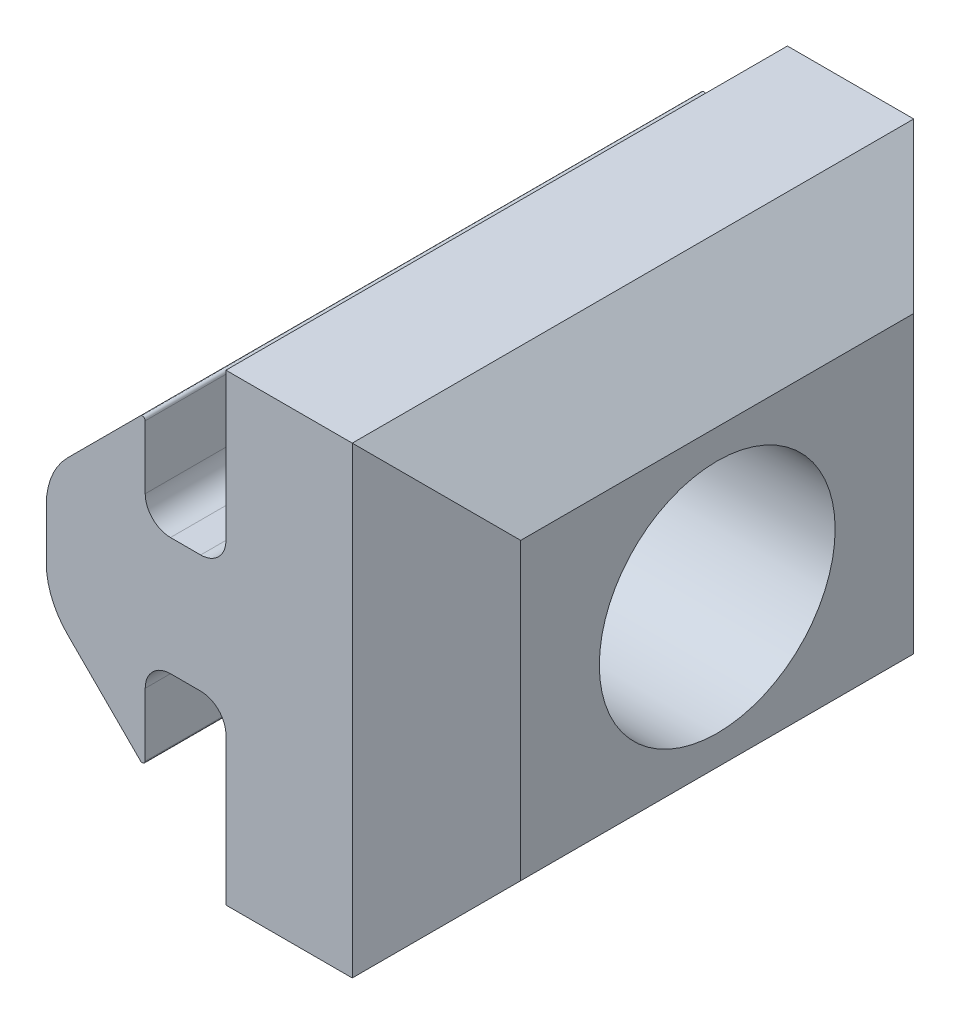
ISO-10303-21;
HEADER;
FILE_DESCRIPTION(('STEP AP214'),'2;1');
FILE_NAME('part.step','',(''),(''),'','','');
FILE_SCHEMA(('AUTOMOTIVE_DESIGN { 1 0 10303 214 1 1 1 1 }'));
ENDSEC;
DATA;
#1=APPLICATION_CONTEXT('core data for automotive mechanical design processes');
#2=APPLICATION_PROTOCOL_DEFINITION('international standard','automotive_design',2000,#1);
#3=PRODUCT_CONTEXT('',#1,'mechanical');
#4=PRODUCT('Part','Part','',(#3));
#5=PRODUCT_RELATED_PRODUCT_CATEGORY('part','',(#4));
#6=PRODUCT_DEFINITION_FORMATION('','',#4);
#7=PRODUCT_DEFINITION_CONTEXT('part definition',#1,'design');
#8=PRODUCT_DEFINITION('design','',#6,#7);
#9=PRODUCT_DEFINITION_SHAPE('','',#8);
#10=(LENGTH_UNIT() NAMED_UNIT(*) SI_UNIT(.MILLI.,.METRE.));
#11=(NAMED_UNIT(*) PLANE_ANGLE_UNIT() SI_UNIT($,.RADIAN.));
#12=(NAMED_UNIT(*) SI_UNIT($,.STERADIAN.) SOLID_ANGLE_UNIT());
#13=UNCERTAINTY_MEASURE_WITH_UNIT(LENGTH_MEASURE(1.E-05),#10,'distance_accuracy_value','');
#14=(GEOMETRIC_REPRESENTATION_CONTEXT(3) GLOBAL_UNCERTAINTY_ASSIGNED_CONTEXT((#13)) GLOBAL_UNIT_ASSIGNED_CONTEXT((#10,
#11,#12)) REPRESENTATION_CONTEXT('',''));
#15=CARTESIAN_POINT('',(0.,0.,0.));
#16=DIRECTION('',(0.,0.,1.));
#17=DIRECTION('',(1.,0.,0.));
#18=AXIS2_PLACEMENT_3D('',#15,#16,#17);
#19=CARTESIAN_POINT('',(-1.38582598381851,-2.26642728526669,20.));
#20=DIRECTION('',(0.,0.,-1.));
#21=DIRECTION('',(-1.,0.,0.));
#22=AXIS2_PLACEMENT_3D('',#19,#20,#21);
#23=CYLINDRICAL_SURFACE('',#22,0.900000000000001);
#24=CARTESIAN_POINT('',(-1.38582598381851,-2.26642728526669,0.));
#25=DIRECTION('',(0.,0.,-1.));
#26=DIRECTION('',(1.,0.,0.));
#27=AXIS2_PLACEMENT_3D('',#24,#25,#26);
#28=CIRCLE('',#27,0.900000000000001);
#29=CARTESIAN_POINT('',(-1.38582598381851,-1.36642728526669,0.));
#30=VERTEX_POINT('',#29);
#31=CARTESIAN_POINT('',(-0.485825983818514,-2.26642728526669,0.));
#32=VERTEX_POINT('',#31);
#33=EDGE_CURVE('E217',#30,#32,#28,.T.);
#34=ORIENTED_EDGE('',*,*,#33,.T.);
#35=DIRECTION('',(0.,0.,-1.));
#36=VECTOR('',#35,1.);
#37=CARTESIAN_POINT('',(-0.485825983818514,-2.26642728526669,20.));
#38=LINE('',#37,#36);
#39=CARTESIAN_POINT('',(-0.485825983818514,-2.26642728526669,20.));
#40=VERTEX_POINT('',#39);
#41=EDGE_CURVE('E197',#40,#32,#38,.T.);
#42=ORIENTED_EDGE('',*,*,#41,.F.);
#43=CARTESIAN_POINT('',(-1.38582598381851,-2.26642728526669,20.));
#44=DIRECTION('',(0.,0.,-1.));
#45=DIRECTION('',(1.,0.,0.));
#46=AXIS2_PLACEMENT_3D('',#43,#44,#45);
#47=CIRCLE('',#46,0.900000000000001);
#48=CARTESIAN_POINT('',(-1.38582598381851,-1.36642728526669,20.));
#49=VERTEX_POINT('',#48);
#50=EDGE_CURVE('E204',#49,#40,#47,.T.);
#51=ORIENTED_EDGE('',*,*,#50,.F.);
#52=DIRECTION('',(0.,0.,-1.));
#53=VECTOR('',#52,1.);
#54=CARTESIAN_POINT('',(-1.38582598381851,-1.36642728526669,20.));
#55=LINE('',#54,#53);
#56=EDGE_CURVE('E323',#49,#30,#55,.T.);
#57=ORIENTED_EDGE('',*,*,#56,.T.);
#58=EDGE_LOOP('',(#34,#42,#51,#57));
#59=FACE_BOUND('',#58,.T.);
#60=ADVANCED_FACE('F41',(#59),#23,.F.);
#61=CARTESIAN_POINT('',(-0.485825983818514,-7.51642728526669,20.));
#62=DIRECTION('',(1.,0.,0.));
#63=DIRECTION('',(0.,1.,0.));
#64=AXIS2_PLACEMENT_3D('',#61,#62,#63);
#65=PLANE('',#64);
#66=DIRECTION('',(0.,-1.,0.));
#67=VECTOR('',#66,1.);
#68=CARTESIAN_POINT('',(-0.485825983818514,-7.51642728526669,0.));
#69=LINE('',#68,#67);
#70=CARTESIAN_POINT('',(-0.485825983818514,-7.51642728526669,0.));
#71=VERTEX_POINT('',#70);
#72=EDGE_CURVE('E265',#32,#71,#69,.T.);
#73=ORIENTED_EDGE('',*,*,#72,.T.);
#74=DIRECTION('',(0.,0.,-1.));
#75=VECTOR('',#74,1.);
#76=CARTESIAN_POINT('',(-0.485825983818514,-7.51642728526669,20.));
#77=LINE('',#76,#75);
#78=CARTESIAN_POINT('',(-0.485825983818514,-7.51642728526669,20.));
#79=VERTEX_POINT('',#78);
#80=EDGE_CURVE('E200',#79,#71,#77,.T.);
#81=ORIENTED_EDGE('',*,*,#80,.F.);
#82=DIRECTION('',(0.,-1.,0.));
#83=VECTOR('',#82,1.);
#84=CARTESIAN_POINT('',(-0.485825983818514,-7.51642728526669,20.));
#85=LINE('',#84,#83);
#86=EDGE_CURVE('E193',#40,#79,#85,.T.);
#87=ORIENTED_EDGE('',*,*,#86,.F.);
#88=ORIENTED_EDGE('',*,*,#41,.T.);
#89=EDGE_LOOP('',(#73,#81,#87,#88));
#90=FACE_BOUND('',#89,.T.);
#91=ADVANCED_FACE('F195',(#90),#65,.F.);
#92=CARTESIAN_POINT('',(7.01417401618149,-7.51642728526669,20.));
#93=DIRECTION('',(0.,1.,0.));
#94=DIRECTION('',(0.,0.,1.));
#95=AXIS2_PLACEMENT_3D('',#92,#93,#94);
#96=PLANE('',#95);
#97=DIRECTION('',(1.,0.,0.));
#98=VECTOR('',#97,1.);
#99=CARTESIAN_POINT('',(7.01417401618149,-7.51642728526669,0.));
#100=LINE('',#99,#98);
#101=CARTESIAN_POINT('',(4.01417401618148,-7.51642728526669,0.));
#102=VERTEX_POINT('',#101);
#103=EDGE_CURVE('E268',#71,#102,#100,.T.);
#104=ORIENTED_EDGE('',*,*,#103,.T.);
#105=DIRECTION('',(0.,0.,1.));
#106=VECTOR('',#105,1.);
#107=CARTESIAN_POINT('',(4.01417401618148,-7.51642728526669,20.));
#108=LINE('',#107,#106);
#109=CARTESIAN_POINT('',(4.01417401618148,-7.51642728526669,20.));
#110=VERTEX_POINT('',#109);
#111=EDGE_CURVE('E238',#102,#110,#108,.T.);
#112=ORIENTED_EDGE('',*,*,#111,.T.);
#113=DIRECTION('',(1.,0.,0.));
#114=VECTOR('',#113,1.);
#115=CARTESIAN_POINT('',(7.01417401618149,-7.51642728526669,20.));
#116=LINE('',#115,#114);
#117=EDGE_CURVE('E203',#79,#110,#116,.T.);
#118=ORIENTED_EDGE('',*,*,#117,.F.);
#119=ORIENTED_EDGE('',*,*,#80,.T.);
#120=EDGE_LOOP('',(#104,#112,#118,#119));
#121=FACE_BOUND('',#120,.T.);
#122=ADVANCED_FACE('F456',(#121),#96,.F.);
#123=CARTESIAN_POINT('',(7.01417401618148,8.98357271473331,20.));
#124=DIRECTION('',(-1.,0.,0.));
#125=DIRECTION('',(0.,-1.,0.));
#126=AXIS2_PLACEMENT_3D('',#123,#124,#125);
#127=PLANE('',#126);
#128=CARTESIAN_POINT('',(7.01417401618149,0.733572714733309,10.));
#129=DIRECTION('',(1.,0.,0.));
#130=DIRECTION('',(0.,1.,0.));
#131=AXIS2_PLACEMENT_3D('',#128,#129,#130);
#132=CIRCLE('',#131,4.2);
#133=CARTESIAN_POINT('',(7.01417401618148,4.93357271473331,10.));
#134=VERTEX_POINT('',#133);
#135=EDGE_CURVE('E738',#134,#134,#132,.T.);
#136=ORIENTED_EDGE('',*,*,#135,.F.);
#137=EDGE_LOOP('',(#136));
#138=FACE_BOUND('',#137,.T.);
#139=DIRECTION('',(0.,-1.,0.));
#140=VECTOR('',#139,1.);
#141=CARTESIAN_POINT('',(7.01417401618149,-7.51642728526669,17.));
#142=LINE('',#141,#140);
#143=CARTESIAN_POINT('',(7.01417401618148,5.98357271473331,17.));
#144=VERTEX_POINT('',#143);
#145=CARTESIAN_POINT('',(7.01417401618149,-4.51642728526669,17.));
#146=VERTEX_POINT('',#145);
#147=EDGE_CURVE('E231',#144,#146,#142,.T.);
#148=ORIENTED_EDGE('',*,*,#147,.T.);
#149=DIRECTION('',(0.,0.,-1.));
#150=VECTOR('',#149,1.);
#151=CARTESIAN_POINT('',(7.01417401618149,-4.51642728526669,20.));
#152=LINE('',#151,#150);
#153=CARTESIAN_POINT('',(7.01417401618149,-4.51642728526669,3.));
#154=VERTEX_POINT('',#153);
#155=EDGE_CURVE('E234',#146,#154,#152,.T.);
#156=ORIENTED_EDGE('',*,*,#155,.T.);
#157=DIRECTION('',(0.,1.,0.));
#158=VECTOR('',#157,1.);
#159=CARTESIAN_POINT('',(7.01417401618148,8.98357271473331,3.));
#160=LINE('',#159,#158);
#161=CARTESIAN_POINT('',(7.01417401618148,5.98357271473331,3.));
#162=VERTEX_POINT('',#161);
#163=EDGE_CURVE('E219',#154,#162,#160,.T.);
#164=ORIENTED_EDGE('',*,*,#163,.T.);
#165=DIRECTION('',(0.,0.,1.));
#166=VECTOR('',#165,1.);
#167=CARTESIAN_POINT('',(7.01417401618148,5.98357271473331,20.));
#168=LINE('',#167,#166);
#169=EDGE_CURVE('E223',#162,#144,#168,.T.);
#170=ORIENTED_EDGE('',*,*,#169,.T.);
#171=EDGE_LOOP('',(#148,#156,#164,#170));
#172=FACE_BOUND('',#171,.T.);
#173=ADVANCED_FACE('F571',(#138,#172),#127,.F.);
#174=CARTESIAN_POINT('',(-0.485825983818514,8.98357271473331,20.));
#175=DIRECTION('',(0.,-1.,0.));
#176=DIRECTION('',(0.,0.,-1.));
#177=AXIS2_PLACEMENT_3D('',#174,#175,#176);
#178=PLANE('',#177);
#179=DIRECTION('',(-1.,0.,0.));
#180=VECTOR('',#179,1.);
#181=CARTESIAN_POINT('',(-0.485825983818514,8.98357271473331,20.));
#182=LINE('',#181,#180);
#183=CARTESIAN_POINT('',(4.01417401618147,8.98357271473331,20.));
#184=VERTEX_POINT('',#183);
#185=CARTESIAN_POINT('',(-0.485825983818514,8.98357271473331,20.));
#186=VERTEX_POINT('',#185);
#187=EDGE_CURVE('E459',#184,#186,#182,.T.);
#188=ORIENTED_EDGE('',*,*,#187,.F.);
#189=DIRECTION('',(0.,0.,-1.));
#190=VECTOR('',#189,1.);
#191=CARTESIAN_POINT('',(4.01417401618147,8.98357271473331,20.));
#192=LINE('',#191,#190);
#193=CARTESIAN_POINT('',(4.01417401618147,8.98357271473331,0.));
#194=VERTEX_POINT('',#193);
#195=EDGE_CURVE('E52',#184,#194,#192,.T.);
#196=ORIENTED_EDGE('',*,*,#195,.T.);
#197=DIRECTION('',(-1.,0.,0.));
#198=VECTOR('',#197,1.);
#199=CARTESIAN_POINT('',(-0.485825983818514,8.98357271473331,0.));
#200=LINE('',#199,#198);
#201=CARTESIAN_POINT('',(-0.485825983818514,8.98357271473331,0.));
#202=VERTEX_POINT('',#201);
#203=EDGE_CURVE('E276',#194,#202,#200,.T.);
#204=ORIENTED_EDGE('',*,*,#203,.T.);
#205=DIRECTION('',(0.,0.,-1.));
#206=VECTOR('',#205,1.);
#207=CARTESIAN_POINT('',(-0.485825983818514,8.98357271473331,20.));
#208=LINE('',#207,#206);
#209=EDGE_CURVE('E225',#186,#202,#208,.T.);
#210=ORIENTED_EDGE('',*,*,#209,.F.);
#211=EDGE_LOOP('',(#188,#196,#204,#210));
#212=FACE_BOUND('',#211,.T.);
#213=ADVANCED_FACE('F464',(#212),#178,.F.);
#214=CARTESIAN_POINT('',(-0.485825983818514,3.73357271473331,20.));
#215=DIRECTION('',(1.,0.,0.));
#216=DIRECTION('',(0.,1.,0.));
#217=AXIS2_PLACEMENT_3D('',#214,#215,#216);
#218=PLANE('',#217);
#219=DIRECTION('',(0.,-1.,0.));
#220=VECTOR('',#219,1.);
#221=CARTESIAN_POINT('',(-0.485825983818514,3.73357271473331,0.));
#222=LINE('',#221,#220);
#223=CARTESIAN_POINT('',(-0.485825983818514,3.73357271473331,0.));
#224=VERTEX_POINT('',#223);
#225=EDGE_CURVE('E279',#202,#224,#222,.T.);
#226=ORIENTED_EDGE('',*,*,#225,.T.);
#227=DIRECTION('',(0.,0.,-1.));
#228=VECTOR('',#227,1.);
#229=CARTESIAN_POINT('',(-0.485825983818514,3.73357271473331,20.));
#230=LINE('',#229,#228);
#231=CARTESIAN_POINT('',(-0.485825983818514,3.73357271473331,20.));
#232=VERTEX_POINT('',#231);
#233=EDGE_CURVE('E378',#232,#224,#230,.T.);
#234=ORIENTED_EDGE('',*,*,#233,.F.);
#235=DIRECTION('',(0.,-1.,0.));
#236=VECTOR('',#235,1.);
#237=CARTESIAN_POINT('',(-0.485825983818514,3.73357271473331,20.));
#238=LINE('',#237,#236);
#239=EDGE_CURVE('E389',#186,#232,#238,.T.);
#240=ORIENTED_EDGE('',*,*,#239,.F.);
#241=ORIENTED_EDGE('',*,*,#209,.T.);
#242=EDGE_LOOP('',(#226,#234,#240,#241));
#243=FACE_BOUND('',#242,.T.);
#244=ADVANCED_FACE('F387',(#243),#218,.F.);
#245=CARTESIAN_POINT('',(-1.38582598381851,3.73357271473331,20.));
#246=DIRECTION('',(0.,0.,-1.));
#247=DIRECTION('',(-1.,0.,0.));
#248=AXIS2_PLACEMENT_3D('',#245,#246,#247);
#249=CYLINDRICAL_SURFACE('',#248,0.900000000000001);
#250=CARTESIAN_POINT('',(-1.38582598381851,3.73357271473331,0.));
#251=DIRECTION('',(0.,0.,-1.));
#252=DIRECTION('',(1.,0.,0.));
#253=AXIS2_PLACEMENT_3D('',#250,#251,#252);
#254=CIRCLE('',#253,0.900000000000001);
#255=CARTESIAN_POINT('',(-1.38582598381851,2.83357271473331,0.));
#256=VERTEX_POINT('',#255);
#257=EDGE_CURVE('E282',#224,#256,#254,.T.);
#258=ORIENTED_EDGE('',*,*,#257,.T.);
#259=DIRECTION('',(0.,0.,-1.));
#260=VECTOR('',#259,1.);
#261=CARTESIAN_POINT('',(-1.38582598381851,2.83357271473331,20.));
#262=LINE('',#261,#260);
#263=CARTESIAN_POINT('',(-1.38582598381851,2.83357271473331,20.));
#264=VERTEX_POINT('',#263);
#265=EDGE_CURVE('E374',#264,#256,#262,.T.);
#266=ORIENTED_EDGE('',*,*,#265,.F.);
#267=CARTESIAN_POINT('',(-1.38582598381851,3.73357271473331,20.));
#268=DIRECTION('',(0.,0.,-1.));
#269=DIRECTION('',(1.,0.,0.));
#270=AXIS2_PLACEMENT_3D('',#267,#268,#269);
#271=CIRCLE('',#270,0.900000000000001);
#272=EDGE_CURVE('E407',#232,#264,#271,.T.);
#273=ORIENTED_EDGE('',*,*,#272,.F.);
#274=ORIENTED_EDGE('',*,*,#233,.T.);
#275=EDGE_LOOP('',(#258,#266,#273,#274));
#276=FACE_BOUND('',#275,.T.);
#277=ADVANCED_FACE('F397',(#276),#249,.F.);
#278=CARTESIAN_POINT('',(-2.46120478135976,2.83357271473331,20.));
#279=DIRECTION('',(0.,-1.,0.));
#280=DIRECTION('',(1.,0.,0.));
#281=AXIS2_PLACEMENT_3D('',#278,#279,#280);
#282=PLANE('',#281);
#283=DIRECTION('',(-1.,0.,0.));
#284=VECTOR('',#283,1.);
#285=CARTESIAN_POINT('',(-2.46120478135976,2.83357271473331,0.));
#286=LINE('',#285,#284);
#287=CARTESIAN_POINT('',(-2.46120478135976,2.83357271473331,0.));
#288=VERTEX_POINT('',#287);
#289=EDGE_CURVE('E285',#256,#288,#286,.T.);
#290=ORIENTED_EDGE('',*,*,#289,.T.);
#291=DIRECTION('',(0.,0.,-1.));
#292=VECTOR('',#291,1.);
#293=CARTESIAN_POINT('',(-2.46120478135976,2.83357271473331,20.));
#294=LINE('',#293,#292);
#295=CARTESIAN_POINT('',(-2.46120478135976,2.83357271473331,20.));
#296=VERTEX_POINT('',#295);
#297=EDGE_CURVE('E370',#296,#288,#294,.T.);
#298=ORIENTED_EDGE('',*,*,#297,.F.);
#299=DIRECTION('',(-1.,0.,0.));
#300=VECTOR('',#299,1.);
#301=CARTESIAN_POINT('',(-2.46120478135976,2.83357271473331,20.));
#302=LINE('',#301,#300);
#303=EDGE_CURVE('E403',#264,#296,#302,.T.);
#304=ORIENTED_EDGE('',*,*,#303,.F.);
#305=ORIENTED_EDGE('',*,*,#265,.T.);
#306=EDGE_LOOP('',(#290,#298,#304,#305));
#307=FACE_BOUND('',#306,.T.);
#308=ADVANCED_FACE('F401',(#307),#282,.F.);
#309=CARTESIAN_POINT('',(-2.46120478135976,3.73357271473331,20.));
#310=DIRECTION('',(0.,0.,-1.));
#311=DIRECTION('',(-1.,0.,0.));
#312=AXIS2_PLACEMENT_3D('',#309,#310,#311);
#313=CYLINDRICAL_SURFACE('',#312,0.900000000000001);
#314=CARTESIAN_POINT('',(-2.46120478135976,3.73357271473331,0.));
#315=DIRECTION('',(0.,0.,-1.));
#316=DIRECTION('',(1.,0.,0.));
#317=AXIS2_PLACEMENT_3D('',#314,#315,#316);
#318=CIRCLE('',#317,0.900000000000001);
#319=CARTESIAN_POINT('',(-3.36120478135977,3.73357271473331,0.));
#320=VERTEX_POINT('',#319);
#321=EDGE_CURVE('E288',#288,#320,#318,.T.);
#322=ORIENTED_EDGE('',*,*,#321,.T.);
#323=DIRECTION('',(0.,0.,-1.));
#324=VECTOR('',#323,1.);
#325=CARTESIAN_POINT('',(-3.36120478135977,3.73357271473331,20.));
#326=LINE('',#325,#324);
#327=CARTESIAN_POINT('',(-3.36120478135977,3.73357271473331,20.));
#328=VERTEX_POINT('',#327);
#329=EDGE_CURVE('E366',#328,#320,#326,.T.);
#330=ORIENTED_EDGE('',*,*,#329,.F.);
#331=CARTESIAN_POINT('',(-2.46120478135976,3.73357271473331,20.));
#332=DIRECTION('',(0.,0.,-1.));
#333=DIRECTION('',(1.,0.,0.));
#334=AXIS2_PLACEMENT_3D('',#331,#332,#333);
#335=CIRCLE('',#334,0.900000000000001);
#336=EDGE_CURVE('E406',#296,#328,#335,.T.);
#337=ORIENTED_EDGE('',*,*,#336,.F.);
#338=ORIENTED_EDGE('',*,*,#297,.T.);
#339=EDGE_LOOP('',(#322,#330,#337,#338));
#340=FACE_BOUND('',#339,.T.);
#341=ADVANCED_FACE('F558',(#340),#313,.F.);
#342=CARTESIAN_POINT('',(-3.36120478135977,5.98357271473331,20.));
#343=DIRECTION('',(-1.,0.,0.));
#344=DIRECTION('',(0.,-1.,0.));
#345=AXIS2_PLACEMENT_3D('',#342,#343,#344);
#346=PLANE('',#345);
#347=DIRECTION('',(0.,1.,0.));
#348=VECTOR('',#347,1.);
#349=CARTESIAN_POINT('',(-3.36120478135977,5.98357271473331,0.));
#350=LINE('',#349,#348);
#351=CARTESIAN_POINT('',(-3.36120478135977,5.98357271473331,0.));
#352=VERTEX_POINT('',#351);
#353=EDGE_CURVE('E291',#320,#352,#350,.T.);
#354=ORIENTED_EDGE('',*,*,#353,.T.);
#355=DIRECTION('',(0.,0.,-1.));
#356=VECTOR('',#355,1.);
#357=CARTESIAN_POINT('',(-3.36120478135977,5.98357271473331,20.));
#358=LINE('',#357,#356);
#359=CARTESIAN_POINT('',(-3.36120478135977,5.98357271473331,20.));
#360=VERTEX_POINT('',#359);
#361=EDGE_CURVE('E362',#360,#352,#358,.T.);
#362=ORIENTED_EDGE('',*,*,#361,.F.);
#363=DIRECTION('',(0.,1.,0.));
#364=VECTOR('',#363,1.);
#365=CARTESIAN_POINT('',(-3.36120478135977,5.98357271473331,20.));
#366=LINE('',#365,#364);
#367=EDGE_CURVE('E411',#328,#360,#366,.T.);
#368=ORIENTED_EDGE('',*,*,#367,.F.);
#369=ORIENTED_EDGE('',*,*,#329,.T.);
#370=EDGE_LOOP('',(#354,#362,#368,#369));
#371=FACE_BOUND('',#370,.T.);
#372=ADVANCED_FACE('F554',(#371),#346,.F.);
#373=CARTESIAN_POINT('',(-3.46120478135977,5.98357271473331,20.));
#374=DIRECTION('',(0.,0.,-1.));
#375=DIRECTION('',(-1.,0.,0.));
#376=AXIS2_PLACEMENT_3D('',#373,#374,#375);
#377=CYLINDRICAL_SURFACE('',#376,0.0999999999999998);
#378=CARTESIAN_POINT('',(-3.46120478135977,5.98357271473331,0.));
#379=DIRECTION('',(0.,0.,1.));
#380=DIRECTION('',(1.,0.,0.));
#381=AXIS2_PLACEMENT_3D('',#378,#379,#380);
#382=CIRCLE('',#381,0.0999999999999998);
#383=CARTESIAN_POINT('',(-3.53191545947842,6.05428339285196,0.));
#384=VERTEX_POINT('',#383);
#385=EDGE_CURVE('E294',#352,#384,#382,.T.);
#386=ORIENTED_EDGE('',*,*,#385,.T.);
#387=DIRECTION('',(0.,0.,-1.));
#388=VECTOR('',#387,1.);
#389=CARTESIAN_POINT('',(-3.53191545947842,6.05428339285196,20.));
#390=LINE('',#389,#388);
#391=CARTESIAN_POINT('',(-3.53191545947842,6.05428339285196,20.));
#392=VERTEX_POINT('',#391);
#393=EDGE_CURVE('E358',#392,#384,#390,.T.);
#394=ORIENTED_EDGE('',*,*,#393,.F.);
#395=CARTESIAN_POINT('',(-3.46120478135977,5.98357271473331,20.));
#396=DIRECTION('',(0.,0.,1.));
#397=DIRECTION('',(1.,0.,0.));
#398=AXIS2_PLACEMENT_3D('',#395,#396,#397);
#399=CIRCLE('',#398,0.0999999999999998);
#400=EDGE_CURVE('E418',#360,#392,#399,.T.);
#401=ORIENTED_EDGE('',*,*,#400,.F.);
#402=ORIENTED_EDGE('',*,*,#361,.T.);
#403=EDGE_LOOP('',(#386,#394,#401,#402));
#404=FACE_BOUND('',#403,.T.);
#405=ADVANCED_FACE('F550',(#404),#377,.T.);
#406=CARTESIAN_POINT('',(-6.12430361490354,3.46189523742684,20.));
#407=DIRECTION('',(0.707106781186548,-0.707106781186548,0.));
#408=DIRECTION('',(0.707106781186548,0.707106781186548,0.));
#409=AXIS2_PLACEMENT_3D('',#406,#407,#408);
#410=PLANE('',#409);
#411=DIRECTION('',(-0.707106781186547,-0.707106781186547,0.));
#412=VECTOR('',#411,1.);
#413=CARTESIAN_POINT('',(-6.12430361490354,3.46189523742684,0.));
#414=LINE('',#413,#412);
#415=CARTESIAN_POINT('',(-6.12430361490354,3.46189523742684,0.));
#416=VERTEX_POINT('',#415);
#417=EDGE_CURVE('E297',#384,#416,#414,.T.);
#418=ORIENTED_EDGE('',*,*,#417,.T.);
#419=DIRECTION('',(0.,0.,-1.));
#420=VECTOR('',#419,1.);
#421=CARTESIAN_POINT('',(-6.12430361490354,3.46189523742684,20.));
#422=LINE('',#421,#420);
#423=CARTESIAN_POINT('',(-6.12430361490354,3.46189523742684,20.));
#424=VERTEX_POINT('',#423);
#425=EDGE_CURVE('E354',#424,#416,#422,.T.);
#426=ORIENTED_EDGE('',*,*,#425,.F.);
#427=DIRECTION('',(-0.707106781186547,-0.707106781186547,0.));
#428=VECTOR('',#427,1.);
#429=CARTESIAN_POINT('',(-6.12430361490354,3.46189523742684,20.));
#430=LINE('',#429,#428);
#431=EDGE_CURVE('E421',#392,#424,#430,.T.);
#432=ORIENTED_EDGE('',*,*,#431,.F.);
#433=ORIENTED_EDGE('',*,*,#393,.T.);
#434=EDGE_LOOP('',(#418,#426,#432,#433));
#435=FACE_BOUND('',#434,.T.);
#436=ADVANCED_FACE('F546',(#435),#410,.F.);
#437=CARTESIAN_POINT('',(-4.28582598381852,1.62341760634182,20.));
#438=DIRECTION('',(0.,0.,-1.));
#439=DIRECTION('',(-1.,0.,0.));
#440=AXIS2_PLACEMENT_3D('',#437,#438,#439);
#441=CYLINDRICAL_SURFACE('',#440,2.6);
#442=CARTESIAN_POINT('',(-4.28582598381852,1.62341760634182,0.));
#443=DIRECTION('',(0.,0.,1.));
#444=DIRECTION('',(1.,0.,0.));
#445=AXIS2_PLACEMENT_3D('',#442,#443,#444);
#446=CIRCLE('',#445,2.6);
#447=CARTESIAN_POINT('',(-6.88582598381852,1.62341760634182,0.));
#448=VERTEX_POINT('',#447);
#449=EDGE_CURVE('E300',#416,#448,#446,.T.);
#450=ORIENTED_EDGE('',*,*,#449,.T.);
#451=DIRECTION('',(0.,0.,-1.));
#452=VECTOR('',#451,1.);
#453=CARTESIAN_POINT('',(-6.88582598381852,1.62341760634182,20.));
#454=LINE('',#453,#452);
#455=CARTESIAN_POINT('',(-6.88582598381852,1.62341760634182,20.));
#456=VERTEX_POINT('',#455);
#457=EDGE_CURVE('E350',#456,#448,#454,.T.);
#458=ORIENTED_EDGE('',*,*,#457,.F.);
#459=CARTESIAN_POINT('',(-4.28582598381852,1.62341760634182,20.));
#460=DIRECTION('',(0.,0.,1.));
#461=DIRECTION('',(1.,0.,0.));
#462=AXIS2_PLACEMENT_3D('',#459,#460,#461);
#463=CIRCLE('',#462,2.6);
#464=EDGE_CURVE('E424',#424,#456,#463,.T.);
#465=ORIENTED_EDGE('',*,*,#464,.F.);
#466=ORIENTED_EDGE('',*,*,#425,.T.);
#467=EDGE_LOOP('',(#450,#458,#465,#466));
#468=FACE_BOUND('',#467,.T.);
#469=ADVANCED_FACE('F542',(#468),#441,.T.);
#470=CARTESIAN_POINT('',(-6.88582598381852,-0.156272176875199,20.));
#471=DIRECTION('',(1.,0.,0.));
#472=DIRECTION('',(0.,0.,-1.));
#473=AXIS2_PLACEMENT_3D('',#470,#471,#472);
#474=PLANE('',#473);
#475=DIRECTION('',(0.,-1.,0.));
#476=VECTOR('',#475,1.);
#477=CARTESIAN_POINT('',(-6.88582598381852,-0.156272176875199,0.));
#478=LINE('',#477,#476);
#479=CARTESIAN_POINT('',(-6.88582598381852,-0.156272176875199,0.));
#480=VERTEX_POINT('',#479);
#481=EDGE_CURVE('E303',#448,#480,#478,.T.);
#482=ORIENTED_EDGE('',*,*,#481,.T.);
#483=DIRECTION('',(0.,0.,-1.));
#484=VECTOR('',#483,1.);
#485=CARTESIAN_POINT('',(-6.88582598381852,-0.156272176875199,20.));
#486=LINE('',#485,#484);
#487=CARTESIAN_POINT('',(-6.88582598381852,-0.156272176875199,20.));
#488=VERTEX_POINT('',#487);
#489=EDGE_CURVE('E346',#488,#480,#486,.T.);
#490=ORIENTED_EDGE('',*,*,#489,.F.);
#491=DIRECTION('',(0.,-1.,0.));
#492=VECTOR('',#491,1.);
#493=CARTESIAN_POINT('',(-6.88582598381852,-0.156272176875199,20.));
#494=LINE('',#493,#492);
#495=EDGE_CURVE('E427',#456,#488,#494,.T.);
#496=ORIENTED_EDGE('',*,*,#495,.F.);
#497=ORIENTED_EDGE('',*,*,#457,.T.);
#498=EDGE_LOOP('',(#482,#490,#496,#497));
#499=FACE_BOUND('',#498,.T.);
#500=ADVANCED_FACE('F538',(#499),#474,.F.);
#501=CARTESIAN_POINT('',(-4.28582598381852,-0.156272176875199,20.));
#502=DIRECTION('',(0.,0.,-1.));
#503=DIRECTION('',(-1.,0.,0.));
#504=AXIS2_PLACEMENT_3D('',#501,#502,#503);
#505=CYLINDRICAL_SURFACE('',#504,2.6);
#506=CARTESIAN_POINT('',(-4.28582598381852,-0.156272176875199,0.));
#507=DIRECTION('',(0.,0.,1.));
#508=DIRECTION('',(1.,0.,0.));
#509=AXIS2_PLACEMENT_3D('',#506,#507,#508);
#510=CIRCLE('',#509,2.6);
#511=CARTESIAN_POINT('',(-6.12430361490354,-1.99474980796022,0.));
#512=VERTEX_POINT('',#511);
#513=EDGE_CURVE('E306',#480,#512,#510,.T.);
#514=ORIENTED_EDGE('',*,*,#513,.T.);
#515=DIRECTION('',(0.,0.,-1.));
#516=VECTOR('',#515,1.);
#517=CARTESIAN_POINT('',(-6.12430361490354,-1.99474980796022,20.));
#518=LINE('',#517,#516);
#519=CARTESIAN_POINT('',(-6.12430361490354,-1.99474980796022,20.));
#520=VERTEX_POINT('',#519);
#521=EDGE_CURVE('E342',#520,#512,#518,.T.);
#522=ORIENTED_EDGE('',*,*,#521,.F.);
#523=CARTESIAN_POINT('',(-4.28582598381852,-0.156272176875199,20.));
#524=DIRECTION('',(0.,0.,1.));
#525=DIRECTION('',(1.,0.,0.));
#526=AXIS2_PLACEMENT_3D('',#523,#524,#525);
#527=CIRCLE('',#526,2.6);
#528=EDGE_CURVE('E430',#488,#520,#527,.T.);
#529=ORIENTED_EDGE('',*,*,#528,.F.);
#530=ORIENTED_EDGE('',*,*,#489,.T.);
#531=EDGE_LOOP('',(#514,#522,#529,#530));
#532=FACE_BOUND('',#531,.T.);
#533=ADVANCED_FACE('F534',(#532),#505,.T.);
#534=CARTESIAN_POINT('',(-3.53191545947842,-4.58713796338534,20.));
#535=DIRECTION('',(0.707106781186548,0.707106781186547,0.));
#536=DIRECTION('',(-0.707106781186547,0.707106781186548,0.));
#537=AXIS2_PLACEMENT_3D('',#534,#535,#536);
#538=PLANE('',#537);
#539=DIRECTION('',(0.707106781186547,-0.707106781186548,0.));
#540=VECTOR('',#539,1.);
#541=CARTESIAN_POINT('',(-3.53191545947842,-4.58713796338534,0.));
#542=LINE('',#541,#540);
#543=CARTESIAN_POINT('',(-3.53191545947842,-4.58713796338534,0.));
#544=VERTEX_POINT('',#543);
#545=EDGE_CURVE('E309',#512,#544,#542,.T.);
#546=ORIENTED_EDGE('',*,*,#545,.T.);
#547=DIRECTION('',(0.,0.,-1.));
#548=VECTOR('',#547,1.);
#549=CARTESIAN_POINT('',(-3.53191545947842,-4.58713796338534,20.));
#550=LINE('',#549,#548);
#551=CARTESIAN_POINT('',(-3.53191545947842,-4.58713796338534,20.));
#552=VERTEX_POINT('',#551);
#553=EDGE_CURVE('E338',#552,#544,#550,.T.);
#554=ORIENTED_EDGE('',*,*,#553,.F.);
#555=DIRECTION('',(0.707106781186547,-0.707106781186548,0.));
#556=VECTOR('',#555,1.);
#557=CARTESIAN_POINT('',(-3.53191545947842,-4.58713796338534,20.));
#558=LINE('',#557,#556);
#559=EDGE_CURVE('E433',#520,#552,#558,.T.);
#560=ORIENTED_EDGE('',*,*,#559,.F.);
#561=ORIENTED_EDGE('',*,*,#521,.T.);
#562=EDGE_LOOP('',(#546,#554,#560,#561));
#563=FACE_BOUND('',#562,.T.);
#564=ADVANCED_FACE('F530',(#563),#538,.F.);
#565=CARTESIAN_POINT('',(-3.46120478135977,-4.51642728526669,20.));
#566=DIRECTION('',(0.,0.,-1.));
#567=DIRECTION('',(-1.,0.,0.));
#568=AXIS2_PLACEMENT_3D('',#565,#566,#567);
#569=CYLINDRICAL_SURFACE('',#568,0.1);
#570=CARTESIAN_POINT('',(-3.46120478135977,-4.51642728526669,0.));
#571=DIRECTION('',(0.,0.,1.));
#572=DIRECTION('',(1.,0.,0.));
#573=AXIS2_PLACEMENT_3D('',#570,#571,#572);
#574=CIRCLE('',#573,0.1);
#575=CARTESIAN_POINT('',(-3.36120478135977,-4.51642728526669,0.));
#576=VERTEX_POINT('',#575);
#577=EDGE_CURVE('E312',#544,#576,#574,.T.);
#578=ORIENTED_EDGE('',*,*,#577,.T.);
#579=DIRECTION('',(0.,0.,-1.));
#580=VECTOR('',#579,1.);
#581=CARTESIAN_POINT('',(-3.36120478135977,-4.51642728526669,20.));
#582=LINE('',#581,#580);
#583=CARTESIAN_POINT('',(-3.36120478135977,-4.51642728526669,20.));
#584=VERTEX_POINT('',#583);
#585=EDGE_CURVE('E334',#584,#576,#582,.T.);
#586=ORIENTED_EDGE('',*,*,#585,.F.);
#587=CARTESIAN_POINT('',(-3.46120478135977,-4.51642728526669,20.));
#588=DIRECTION('',(0.,0.,1.));
#589=DIRECTION('',(1.,0.,0.));
#590=AXIS2_PLACEMENT_3D('',#587,#588,#589);
#591=CIRCLE('',#590,0.1);
#592=EDGE_CURVE('E436',#552,#584,#591,.T.);
#593=ORIENTED_EDGE('',*,*,#592,.F.);
#594=ORIENTED_EDGE('',*,*,#553,.T.);
#595=EDGE_LOOP('',(#578,#586,#593,#594));
#596=FACE_BOUND('',#595,.T.);
#597=ADVANCED_FACE('F526',(#596),#569,.T.);
#598=CARTESIAN_POINT('',(-3.36120478135977,-2.26642728526669,20.));
#599=DIRECTION('',(-1.,0.,0.));
#600=DIRECTION('',(0.,-1.,0.));
#601=AXIS2_PLACEMENT_3D('',#598,#599,#600);
#602=PLANE('',#601);
#603=DIRECTION('',(0.,1.,0.));
#604=VECTOR('',#603,1.);
#605=CARTESIAN_POINT('',(-3.36120478135977,-2.26642728526669,0.));
#606=LINE('',#605,#604);
#607=CARTESIAN_POINT('',(-3.36120478135977,-2.26642728526669,0.));
#608=VERTEX_POINT('',#607);
#609=EDGE_CURVE('E315',#576,#608,#606,.T.);
#610=ORIENTED_EDGE('',*,*,#609,.T.);
#611=DIRECTION('',(0.,0.,-1.));
#612=VECTOR('',#611,1.);
#613=CARTESIAN_POINT('',(-3.36120478135977,-2.26642728526669,20.));
#614=LINE('',#613,#612);
#615=CARTESIAN_POINT('',(-3.36120478135977,-2.26642728526669,20.));
#616=VERTEX_POINT('',#615);
#617=EDGE_CURVE('E330',#616,#608,#614,.T.);
#618=ORIENTED_EDGE('',*,*,#617,.F.);
#619=DIRECTION('',(0.,1.,0.));
#620=VECTOR('',#619,1.);
#621=CARTESIAN_POINT('',(-3.36120478135977,-2.26642728526669,20.));
#622=LINE('',#621,#620);
#623=EDGE_CURVE('E439',#584,#616,#622,.T.);
#624=ORIENTED_EDGE('',*,*,#623,.F.);
#625=ORIENTED_EDGE('',*,*,#585,.T.);
#626=EDGE_LOOP('',(#610,#618,#624,#625));
#627=FACE_BOUND('',#626,.T.);
#628=ADVANCED_FACE('F523',(#627),#602,.F.);
#629=CARTESIAN_POINT('',(-2.46120478135976,-2.26642728526669,20.));
#630=DIRECTION('',(0.,0.,-1.));
#631=DIRECTION('',(-1.,0.,0.));
#632=AXIS2_PLACEMENT_3D('',#629,#630,#631);
#633=CYLINDRICAL_SURFACE('',#632,0.900000000000001);
#634=CARTESIAN_POINT('',(-2.46120478135976,-2.26642728526669,0.));
#635=DIRECTION('',(0.,0.,-1.));
#636=DIRECTION('',(1.,0.,0.));
#637=AXIS2_PLACEMENT_3D('',#634,#635,#636);
#638=CIRCLE('',#637,0.900000000000001);
#639=CARTESIAN_POINT('',(-2.46120478135976,-1.36642728526669,0.));
#640=VERTEX_POINT('',#639);
#641=EDGE_CURVE('E318',#608,#640,#638,.T.);
#642=ORIENTED_EDGE('',*,*,#641,.T.);
#643=DIRECTION('',(0.,0.,-1.));
#644=VECTOR('',#643,1.);
#645=CARTESIAN_POINT('',(-2.46120478135976,-1.36642728526669,20.));
#646=LINE('',#645,#644);
#647=CARTESIAN_POINT('',(-2.46120478135976,-1.36642728526669,20.));
#648=VERTEX_POINT('',#647);
#649=EDGE_CURVE('E326',#648,#640,#646,.T.);
#650=ORIENTED_EDGE('',*,*,#649,.F.);
#651=CARTESIAN_POINT('',(-2.46120478135976,-2.26642728526669,20.));
#652=DIRECTION('',(0.,0.,-1.));
#653=DIRECTION('',(1.,0.,0.));
#654=AXIS2_PLACEMENT_3D('',#651,#652,#653);
#655=CIRCLE('',#654,0.900000000000001);
#656=EDGE_CURVE('E441',#616,#648,#655,.T.);
#657=ORIENTED_EDGE('',*,*,#656,.F.);
#658=ORIENTED_EDGE('',*,*,#617,.T.);
#659=EDGE_LOOP('',(#642,#650,#657,#658));
#660=FACE_BOUND('',#659,.T.);
#661=ADVANCED_FACE('F449',(#660),#633,.F.);
#662=CARTESIAN_POINT('',(-1.38582598381851,-1.36642728526669,20.));
#663=DIRECTION('',(0.,1.,0.));
#664=DIRECTION('',(0.,0.,1.));
#665=AXIS2_PLACEMENT_3D('',#662,#663,#664);
#666=PLANE('',#665);
#667=DIRECTION('',(1.,0.,0.));
#668=VECTOR('',#667,1.);
#669=CARTESIAN_POINT('',(-1.38582598381851,-1.36642728526669,0.));
#670=LINE('',#669,#668);
#671=EDGE_CURVE('E214',#640,#30,#670,.T.);
#672=ORIENTED_EDGE('',*,*,#671,.T.);
#673=ORIENTED_EDGE('',*,*,#56,.F.);
#674=DIRECTION('',(1.,0.,0.));
#675=VECTOR('',#674,1.);
#676=CARTESIAN_POINT('',(-1.38582598381851,-1.36642728526669,20.));
#677=LINE('',#676,#675);
#678=EDGE_CURVE('E209',#648,#49,#677,.T.);
#679=ORIENTED_EDGE('',*,*,#678,.F.);
#680=ORIENTED_EDGE('',*,*,#649,.T.);
#681=EDGE_LOOP('',(#672,#673,#679,#680));
#682=FACE_BOUND('',#681,.T.);
#683=ADVANCED_FACE('F453',(#682),#666,.F.);
#684=CARTESIAN_POINT('',(-1.38582598381851,-2.26642728526669,20.));
#685=DIRECTION('',(0.,0.,1.));
#686=DIRECTION('',(1.,0.,0.));
#687=AXIS2_PLACEMENT_3D('',#684,#685,#686);
#688=PLANE('',#687);
#689=ORIENTED_EDGE('',*,*,#117,.T.);
#690=DIRECTION('',(0.,1.,0.));
#691=VECTOR('',#690,1.);
#692=CARTESIAN_POINT('',(4.01417401618147,8.98357271473331,20.));
#693=LINE('',#692,#691);
#694=EDGE_CURVE('E67',#110,#184,#693,.T.);
#695=ORIENTED_EDGE('',*,*,#694,.T.);
#696=ORIENTED_EDGE('',*,*,#187,.T.);
#697=ORIENTED_EDGE('',*,*,#239,.T.);
#698=ORIENTED_EDGE('',*,*,#272,.T.);
#699=ORIENTED_EDGE('',*,*,#303,.T.);
#700=ORIENTED_EDGE('',*,*,#336,.T.);
#701=ORIENTED_EDGE('',*,*,#367,.T.);
#702=ORIENTED_EDGE('',*,*,#400,.T.);
#703=ORIENTED_EDGE('',*,*,#431,.T.);
#704=ORIENTED_EDGE('',*,*,#464,.T.);
#705=ORIENTED_EDGE('',*,*,#495,.T.);
#706=ORIENTED_EDGE('',*,*,#528,.T.);
#707=ORIENTED_EDGE('',*,*,#559,.T.);
#708=ORIENTED_EDGE('',*,*,#592,.T.);
#709=ORIENTED_EDGE('',*,*,#623,.T.);
#710=ORIENTED_EDGE('',*,*,#656,.T.);
#711=ORIENTED_EDGE('',*,*,#678,.T.);
#712=ORIENTED_EDGE('',*,*,#50,.T.);
#713=ORIENTED_EDGE('',*,*,#86,.T.);
#714=EDGE_LOOP('',(#689,#695,#696,#697,#698,#699,#700,#701,#702,#703,#704,#705,#706,#707,#708,
#709,#710,#711,#712,#713));
#715=FACE_BOUND('',#714,.T.);
#716=ADVANCED_FACE('F207',(#715),#688,.T.);
#717=CARTESIAN_POINT('',(-1.38582598381851,-2.26642728526669,0.));
#718=DIRECTION('',(0.,0.,1.));
#719=DIRECTION('',(1.,0.,0.));
#720=AXIS2_PLACEMENT_3D('',#717,#718,#719);
#721=PLANE('',#720);
#722=ORIENTED_EDGE('',*,*,#203,.F.);
#723=DIRECTION('',(0.,-1.,0.));
#724=VECTOR('',#723,1.);
#725=CARTESIAN_POINT('',(4.01417401618148,-2.26642728526669,0.));
#726=LINE('',#725,#724);
#727=EDGE_CURVE('E11',#194,#102,#726,.T.);
#728=ORIENTED_EDGE('',*,*,#727,.T.);
#729=ORIENTED_EDGE('',*,*,#103,.F.);
#730=ORIENTED_EDGE('',*,*,#72,.F.);
#731=ORIENTED_EDGE('',*,*,#33,.F.);
#732=ORIENTED_EDGE('',*,*,#671,.F.);
#733=ORIENTED_EDGE('',*,*,#641,.F.);
#734=ORIENTED_EDGE('',*,*,#609,.F.);
#735=ORIENTED_EDGE('',*,*,#577,.F.);
#736=ORIENTED_EDGE('',*,*,#545,.F.);
#737=ORIENTED_EDGE('',*,*,#513,.F.);
#738=ORIENTED_EDGE('',*,*,#481,.F.);
#739=ORIENTED_EDGE('',*,*,#449,.F.);
#740=ORIENTED_EDGE('',*,*,#417,.F.);
#741=ORIENTED_EDGE('',*,*,#385,.F.);
#742=ORIENTED_EDGE('',*,*,#353,.F.);
#743=ORIENTED_EDGE('',*,*,#321,.F.);
#744=ORIENTED_EDGE('',*,*,#289,.F.);
#745=ORIENTED_EDGE('',*,*,#257,.F.);
#746=ORIENTED_EDGE('',*,*,#225,.F.);
#747=EDGE_LOOP('',(#722,#728,#729,#730,#731,#732,#733,#734,#735,#736,#737,#738,#739,#740,#741,
#742,#743,#744,#745,#746));
#748=FACE_BOUND('',#747,.T.);
#749=ADVANCED_FACE('F392',(#748),#721,.F.);
#750=CARTESIAN_POINT('',(4.01417401618147,8.98357271473331,20.));
#751=DIRECTION('',(-0.707106781186546,-0.707106781186549,0.));
#752=DIRECTION('',(0.,0.,-1.));
#753=AXIS2_PLACEMENT_3D('',#750,#751,#752);
#754=PLANE('',#753);
#755=DIRECTION('',(0.577350269189627,-0.577350269189625,0.577350269189625));
#756=VECTOR('',#755,1.);
#757=CARTESIAN_POINT('',(6.01417401618148,6.98357271473331,2.));
#758=LINE('',#757,#756);
#759=EDGE_CURVE('E252',#194,#162,#758,.T.);
#760=ORIENTED_EDGE('',*,*,#759,.F.);
#761=ORIENTED_EDGE('',*,*,#195,.F.);
#762=DIRECTION('',(-0.577350269189627,0.577350269189625,0.577350269189625));
#763=VECTOR('',#762,1.);
#764=CARTESIAN_POINT('',(4.01417401618147,8.98357271473331,20.));
#765=LINE('',#764,#763);
#766=EDGE_CURVE('E46',#144,#184,#765,.T.);
#767=ORIENTED_EDGE('',*,*,#766,.F.);
#768=ORIENTED_EDGE('',*,*,#169,.F.);
#769=EDGE_LOOP('',(#760,#761,#767,#768));
#770=FACE_BOUND('',#769,.T.);
#771=ADVANCED_FACE('F44',(#770),#754,.F.);
#772=CARTESIAN_POINT('',(4.01417401618148,-2.26642728526669,20.));
#773=DIRECTION('',(0.707106781186546,0.,0.707106781186549));
#774=DIRECTION('',(0.,-1.,0.));
#775=AXIS2_PLACEMENT_3D('',#772,#773,#774);
#776=PLANE('',#775);
#777=ORIENTED_EDGE('',*,*,#766,.T.);
#778=ORIENTED_EDGE('',*,*,#694,.F.);
#779=DIRECTION('',(-0.577350269189627,-0.577350269189625,0.577350269189625));
#780=VECTOR('',#779,1.);
#781=CARTESIAN_POINT('',(5.76417401618148,-5.76642728526669,18.25));
#782=LINE('',#781,#780);
#783=EDGE_CURVE('E249',#146,#110,#782,.T.);
#784=ORIENTED_EDGE('',*,*,#783,.F.);
#785=ORIENTED_EDGE('',*,*,#147,.F.);
#786=EDGE_LOOP('',(#777,#778,#784,#785));
#787=FACE_BOUND('',#786,.T.);
#788=ADVANCED_FACE('F473',(#787),#776,.T.);
#789=CARTESIAN_POINT('',(7.01417401618148,8.98357271473331,3.));
#790=DIRECTION('',(-0.707106781186546,0.,0.707106781186549));
#791=DIRECTION('',(0.,1.,0.));
#792=AXIS2_PLACEMENT_3D('',#789,#790,#791);
#793=PLANE('',#792);
#794=ORIENTED_EDGE('',*,*,#759,.T.);
#795=ORIENTED_EDGE('',*,*,#163,.F.);
#796=DIRECTION('',(-0.577350269189627,-0.577350269189625,-0.577350269189625));
#797=VECTOR('',#796,1.);
#798=CARTESIAN_POINT('',(11.5141740161815,-0.0164272852667038,7.49999999999999));
#799=LINE('',#798,#797);
#800=EDGE_CURVE('E246',#102,#154,#799,.F.);
#801=ORIENTED_EDGE('',*,*,#800,.F.);
#802=ORIENTED_EDGE('',*,*,#727,.F.);
#803=EDGE_LOOP('',(#794,#795,#801,#802));
#804=FACE_BOUND('',#803,.T.);
#805=ADVANCED_FACE('F468',(#804),#793,.F.);
#806=CARTESIAN_POINT('',(7.01417401618149,-4.51642728526669,20.));
#807=DIRECTION('',(-0.707106781186546,0.707106781186549,0.));
#808=DIRECTION('',(0.,0.,-1.));
#809=AXIS2_PLACEMENT_3D('',#806,#807,#808);
#810=PLANE('',#809);
#811=ORIENTED_EDGE('',*,*,#783,.T.);
#812=ORIENTED_EDGE('',*,*,#111,.F.);
#813=ORIENTED_EDGE('',*,*,#800,.T.);
#814=ORIENTED_EDGE('',*,*,#155,.F.);
#815=EDGE_LOOP('',(#811,#812,#813,#814));
#816=FACE_BOUND('',#815,.T.);
#817=ADVANCED_FACE('F471',(#816),#810,.F.);
#818=CARTESIAN_POINT('',(1.01417401618148,0.733572714733308,10.));
#819=DIRECTION('',(1.,0.,0.));
#820=DIRECTION('',(0.,1.,0.));
#821=AXIS2_PLACEMENT_3D('',#818,#819,#820);
#822=CYLINDRICAL_SURFACE('',#821,4.2);
#823=CARTESIAN_POINT('',(1.01417401618148,0.733572714733308,10.));
#824=DIRECTION('',(1.,0.,0.));
#825=DIRECTION('',(0.,1.,0.));
#826=AXIS2_PLACEMENT_3D('',#823,#824,#825);
#827=CIRCLE('',#826,4.2);
#828=CARTESIAN_POINT('',(1.01417401618148,4.93357271473331,10.));
#829=VERTEX_POINT('',#828);
#830=EDGE_CURVE('E250',#829,#829,#827,.T.);
#831=ORIENTED_EDGE('',*,*,#830,.F.);
#832=EDGE_LOOP('',(#831));
#833=FACE_BOUND('',#832,.T.);
#834=ORIENTED_EDGE('',*,*,#135,.T.);
#835=EDGE_LOOP('',(#834));
#836=FACE_BOUND('',#835,.T.);
#837=ADVANCED_FACE('F494',(#833,#836),#822,.F.);
#838=CARTESIAN_POINT('',(1.01417401618148,0.733572714733308,10.));
#839=DIRECTION('',(1.,0.,0.));
#840=DIRECTION('',(0.,1.,0.));
#841=AXIS2_PLACEMENT_3D('',#838,#839,#840);
#842=PLANE('',#841);
#843=ORIENTED_EDGE('',*,*,#830,.T.);
#844=EDGE_LOOP('',(#843));
#845=FACE_BOUND('',#844,.T.);
#846=ADVANCED_FACE('F504',(#845),#842,.T.);
#847=CLOSED_SHELL('',(#60,#91,#122,#173,#213,#244,#277,#308,#341,#372,#405,#436,#469,#500,#533,
#564,#597,#628,#661,#683,#716,#749,#771,#788,#805,#817,#837,#846));
#848=MANIFOLD_SOLID_BREP('B2',#847);
#849=ADVANCED_BREP_SHAPE_REPRESENTATION('',(#18,#848),#14);
#850=SHAPE_DEFINITION_REPRESENTATION(#9,#849);
ENDSEC;
END-ISO-10303-21;
